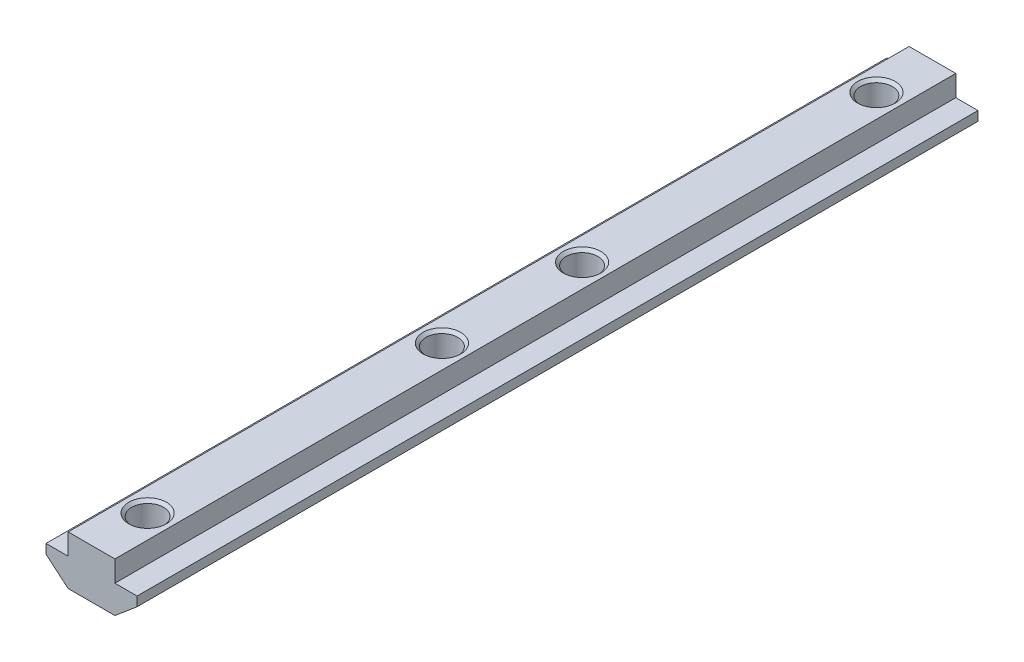
ISO-10303-21;
HEADER;
FILE_DESCRIPTION(('STEP AP214'),'2;1');
FILE_NAME('part.step','',(''),(''),'','','');
FILE_SCHEMA(('AUTOMOTIVE_DESIGN { 1 0 10303 214 1 1 1 1 }'));
ENDSEC;
DATA;
#1=APPLICATION_CONTEXT('core data for automotive mechanical design processes');
#2=APPLICATION_PROTOCOL_DEFINITION('international standard','automotive_design',2000,#1);
#3=PRODUCT_CONTEXT('',#1,'mechanical');
#4=PRODUCT('Part','Part','',(#3));
#5=PRODUCT_RELATED_PRODUCT_CATEGORY('part','',(#4));
#6=PRODUCT_DEFINITION_FORMATION('','',#4);
#7=PRODUCT_DEFINITION_CONTEXT('part definition',#1,'design');
#8=PRODUCT_DEFINITION('design','',#6,#7);
#9=PRODUCT_DEFINITION_SHAPE('','',#8);
#10=(LENGTH_UNIT() NAMED_UNIT(*) SI_UNIT(.MILLI.,.METRE.));
#11=(NAMED_UNIT(*) PLANE_ANGLE_UNIT() SI_UNIT($,.RADIAN.));
#12=(NAMED_UNIT(*) SI_UNIT($,.STERADIAN.) SOLID_ANGLE_UNIT());
#13=UNCERTAINTY_MEASURE_WITH_UNIT(LENGTH_MEASURE(1.E-05),#10,'distance_accuracy_value','');
#14=(GEOMETRIC_REPRESENTATION_CONTEXT(3) GLOBAL_UNCERTAINTY_ASSIGNED_CONTEXT((#13)) GLOBAL_UNIT_ASSIGNED_CONTEXT((#10,
#11,#12)) REPRESENTATION_CONTEXT('',''));
#15=CARTESIAN_POINT('',(0.,0.,0.));
#16=DIRECTION('',(0.,0.,1.));
#17=DIRECTION('',(1.,0.,0.));
#18=AXIS2_PLACEMENT_3D('',#15,#16,#17);
#19=CARTESIAN_POINT('',(-5.,0.,90.));
#20=DIRECTION('',(1.,0.,0.));
#21=DIRECTION('',(0.,1.,0.));
#22=AXIS2_PLACEMENT_3D('',#19,#20,#21);
#23=PLANE('',#22);
#24=DIRECTION('',(0.,-1.,0.));
#25=VECTOR('',#24,1.);
#26=CARTESIAN_POINT('',(-5.,0.,-90.));
#27=LINE('',#26,#25);
#28=CARTESIAN_POINT('',(-5.,0.,-90.));
#29=VERTEX_POINT('',#28);
#30=CARTESIAN_POINT('',(-5.,-4.5,-90.));
#31=VERTEX_POINT('',#30);
#32=EDGE_CURVE('E145',#29,#31,#27,.T.);
#33=ORIENTED_EDGE('',*,*,#32,.T.);
#34=DIRECTION('',(0.,0.,-1.));
#35=VECTOR('',#34,1.);
#36=CARTESIAN_POINT('',(-5.,-4.5,90.));
#37=LINE('',#36,#35);
#38=CARTESIAN_POINT('',(-5.,-4.5,90.));
#39=VERTEX_POINT('',#38);
#40=EDGE_CURVE('E11',#39,#31,#37,.T.);
#41=ORIENTED_EDGE('',*,*,#40,.F.);
#42=DIRECTION('',(0.,-1.,0.));
#43=VECTOR('',#42,1.);
#44=CARTESIAN_POINT('',(-5.,0.,90.));
#45=LINE('',#44,#43);
#46=CARTESIAN_POINT('',(-5.,0.,90.));
#47=VERTEX_POINT('',#46);
#48=EDGE_CURVE('E164',#47,#39,#45,.T.);
#49=ORIENTED_EDGE('',*,*,#48,.F.);
#50=DIRECTION('',(0.,0.,-1.));
#51=VECTOR('',#50,1.);
#52=CARTESIAN_POINT('',(-5.,0.,90.));
#53=LINE('',#52,#51);
#54=EDGE_CURVE('E141',#47,#29,#53,.T.);
#55=ORIENTED_EDGE('',*,*,#54,.T.);
#56=EDGE_LOOP('',(#33,#41,#49,#55));
#57=FACE_BOUND('',#56,.T.);
#58=ADVANCED_FACE('F37',(#57),#23,.F.);
#59=CARTESIAN_POINT('',(-5.,-4.5,90.));
#60=DIRECTION('',(0.,-1.,0.));
#61=DIRECTION('',(1.,0.,0.));
#62=AXIS2_PLACEMENT_3D('',#59,#60,#61);
#63=PLANE('',#62);
#64=DIRECTION('',(-1.,0.,0.));
#65=VECTOR('',#64,1.);
#66=CARTESIAN_POINT('',(-5.,-4.5,-90.));
#67=LINE('',#66,#65);
#68=CARTESIAN_POINT('',(-9.75,-4.5,-90.));
#69=VERTEX_POINT('',#68);
#70=EDGE_CURVE('E148',#31,#69,#67,.T.);
#71=ORIENTED_EDGE('',*,*,#70,.T.);
#72=DIRECTION('',(0.,0.,-1.));
#73=VECTOR('',#72,1.);
#74=CARTESIAN_POINT('',(-9.75,-4.5,90.));
#75=LINE('',#74,#73);
#76=CARTESIAN_POINT('',(-9.75,-4.5,90.));
#77=VERTEX_POINT('',#76);
#78=EDGE_CURVE('E45',#77,#69,#75,.T.);
#79=ORIENTED_EDGE('',*,*,#78,.F.);
#80=DIRECTION('',(-1.,0.,0.));
#81=VECTOR('',#80,1.);
#82=CARTESIAN_POINT('',(-5.,-4.5,90.));
#83=LINE('',#82,#81);
#84=EDGE_CURVE('E102',#39,#77,#83,.T.);
#85=ORIENTED_EDGE('',*,*,#84,.F.);
#86=ORIENTED_EDGE('',*,*,#40,.T.);
#87=EDGE_LOOP('',(#71,#79,#85,#86));
#88=FACE_BOUND('',#87,.T.);
#89=ADVANCED_FACE('F308',(#88),#63,.F.);
#90=CARTESIAN_POINT('',(-9.75,-4.5,90.));
#91=DIRECTION('',(1.,0.,0.));
#92=DIRECTION('',(0.,0.,-1.));
#93=AXIS2_PLACEMENT_3D('',#90,#91,#92);
#94=PLANE('',#93);
#95=DIRECTION('',(0.,-1.,0.));
#96=VECTOR('',#95,1.);
#97=CARTESIAN_POINT('',(-9.75,-4.5,-90.));
#98=LINE('',#97,#96);
#99=CARTESIAN_POINT('',(-9.75,-6.5,-90.));
#100=VERTEX_POINT('',#99);
#101=EDGE_CURVE('E151',#69,#100,#98,.T.);
#102=ORIENTED_EDGE('',*,*,#101,.T.);
#103=DIRECTION('',(0.,0.,-1.));
#104=VECTOR('',#103,1.);
#105=CARTESIAN_POINT('',(-9.75,-6.5,90.));
#106=LINE('',#105,#104);
#107=CARTESIAN_POINT('',(-9.75,-6.5,90.));
#108=VERTEX_POINT('',#107);
#109=EDGE_CURVE('E177',#108,#100,#106,.T.);
#110=ORIENTED_EDGE('',*,*,#109,.F.);
#111=DIRECTION('',(0.,-1.,0.));
#112=VECTOR('',#111,1.);
#113=CARTESIAN_POINT('',(-9.75,-4.5,90.));
#114=LINE('',#113,#112);
#115=EDGE_CURVE('E185',#77,#108,#114,.T.);
#116=ORIENTED_EDGE('',*,*,#115,.F.);
#117=ORIENTED_EDGE('',*,*,#78,.T.);
#118=EDGE_LOOP('',(#102,#110,#116,#117));
#119=FACE_BOUND('',#118,.T.);
#120=ADVANCED_FACE('F183',(#119),#94,.F.);
#121=CARTESIAN_POINT('',(-9.75,-6.5,90.));
#122=DIRECTION('',(0.64413574578278,0.764911198117051,0.));
#123=DIRECTION('',(-0.764911198117051,0.64413574578278,0.));
#124=AXIS2_PLACEMENT_3D('',#121,#122,#123);
#125=PLANE('',#124);
#126=DIRECTION('',(0.764911198117051,-0.64413574578278,0.));
#127=VECTOR('',#126,1.);
#128=CARTESIAN_POINT('',(-9.75,-6.5,-90.));
#129=LINE('',#128,#127);
#130=CARTESIAN_POINT('',(-5.,-10.5,-90.));
#131=VERTEX_POINT('',#130);
#132=EDGE_CURVE('E153',#100,#131,#129,.T.);
#133=ORIENTED_EDGE('',*,*,#132,.T.);
#134=DIRECTION('',(0.,0.,-1.));
#135=VECTOR('',#134,1.);
#136=CARTESIAN_POINT('',(-5.,-10.5,90.));
#137=LINE('',#136,#135);
#138=CARTESIAN_POINT('',(-5.,-10.5,90.));
#139=VERTEX_POINT('',#138);
#140=EDGE_CURVE('E174',#139,#131,#137,.T.);
#141=ORIENTED_EDGE('',*,*,#140,.F.);
#142=DIRECTION('',(0.764911198117051,-0.64413574578278,0.));
#143=VECTOR('',#142,1.);
#144=CARTESIAN_POINT('',(-9.75,-6.5,90.));
#145=LINE('',#144,#143);
#146=EDGE_CURVE('E203',#108,#139,#145,.T.);
#147=ORIENTED_EDGE('',*,*,#146,.F.);
#148=ORIENTED_EDGE('',*,*,#109,.T.);
#149=EDGE_LOOP('',(#133,#141,#147,#148));
#150=FACE_BOUND('',#149,.T.);
#151=ADVANCED_FACE('F194',(#150),#125,.F.);
#152=CARTESIAN_POINT('',(-5.,-10.5,90.));
#153=DIRECTION('',(0.,1.,0.));
#154=DIRECTION('',(0.,0.,1.));
#155=AXIS2_PLACEMENT_3D('',#152,#153,#154);
#156=PLANE('',#155);
#157=CARTESIAN_POINT('',(0.,-10.5,-78.));
#158=DIRECTION('',(0.,1.,0.));
#159=DIRECTION('',(0.,0.,1.));
#160=AXIS2_PLACEMENT_3D('',#157,#158,#159);
#161=CIRCLE('',#160,4.025);
#162=CARTESIAN_POINT('',(0.,-10.5,-73.975));
#163=VERTEX_POINT('',#162);
#164=EDGE_CURVE('E255',#163,#163,#161,.T.);
#165=ORIENTED_EDGE('',*,*,#164,.T.);
#166=EDGE_LOOP('',(#165));
#167=FACE_BOUND('',#166,.T.);
#168=CARTESIAN_POINT('',(0.,-10.5,-15.));
#169=DIRECTION('',(0.,1.,0.));
#170=DIRECTION('',(0.,0.,1.));
#171=AXIS2_PLACEMENT_3D('',#168,#169,#170);
#172=CIRCLE('',#171,4.025);
#173=CARTESIAN_POINT('',(0.,-10.5,-10.975));
#174=VERTEX_POINT('',#173);
#175=EDGE_CURVE('E243',#174,#174,#172,.T.);
#176=ORIENTED_EDGE('',*,*,#175,.T.);
#177=EDGE_LOOP('',(#176));
#178=FACE_BOUND('',#177,.T.);
#179=CARTESIAN_POINT('',(0.,-10.5,15.));
#180=DIRECTION('',(0.,1.,0.));
#181=DIRECTION('',(0.,0.,1.));
#182=AXIS2_PLACEMENT_3D('',#179,#180,#181);
#183=CIRCLE('',#182,4.025);
#184=CARTESIAN_POINT('',(0.,-10.5,19.025));
#185=VERTEX_POINT('',#184);
#186=EDGE_CURVE('E231',#185,#185,#183,.T.);
#187=ORIENTED_EDGE('',*,*,#186,.T.);
#188=EDGE_LOOP('',(#187));
#189=FACE_BOUND('',#188,.T.);
#190=CARTESIAN_POINT('',(0.,-10.5,78.));
#191=DIRECTION('',(0.,1.,0.));
#192=DIRECTION('',(0.,0.,1.));
#193=AXIS2_PLACEMENT_3D('',#190,#191,#192);
#194=CIRCLE('',#193,4.025);
#195=CARTESIAN_POINT('',(0.,-10.5,82.025));
#196=VERTEX_POINT('',#195);
#197=EDGE_CURVE('E219',#196,#196,#194,.T.);
#198=ORIENTED_EDGE('',*,*,#197,.T.);
#199=EDGE_LOOP('',(#198));
#200=FACE_BOUND('',#199,.T.);
#201=DIRECTION('',(1.,0.,0.));
#202=VECTOR('',#201,1.);
#203=CARTESIAN_POINT('',(-5.,-10.5,-90.));
#204=LINE('',#203,#202);
#205=CARTESIAN_POINT('',(5.,-10.5,-90.));
#206=VERTEX_POINT('',#205);
#207=EDGE_CURVE('E155',#131,#206,#204,.T.);
#208=ORIENTED_EDGE('',*,*,#207,.T.);
#209=DIRECTION('',(0.,0.,-1.));
#210=VECTOR('',#209,1.);
#211=CARTESIAN_POINT('',(5.,-10.5,90.));
#212=LINE('',#211,#210);
#213=CARTESIAN_POINT('',(5.,-10.5,90.));
#214=VERTEX_POINT('',#213);
#215=EDGE_CURVE('E171',#214,#206,#212,.T.);
#216=ORIENTED_EDGE('',*,*,#215,.F.);
#217=DIRECTION('',(1.,0.,0.));
#218=VECTOR('',#217,1.);
#219=CARTESIAN_POINT('',(-5.,-10.5,90.));
#220=LINE('',#219,#218);
#221=EDGE_CURVE('E200',#139,#214,#220,.T.);
#222=ORIENTED_EDGE('',*,*,#221,.F.);
#223=ORIENTED_EDGE('',*,*,#140,.T.);
#224=EDGE_LOOP('',(#208,#216,#222,#223));
#225=FACE_BOUND('',#224,.T.);
#226=ADVANCED_FACE('F198',(#167,#178,#189,#200,#225),#156,.F.);
#227=CARTESIAN_POINT('',(9.75,-6.5,90.));
#228=DIRECTION('',(-0.64413574578278,0.764911198117051,0.));
#229=DIRECTION('',(-0.764911198117051,-0.64413574578278,0.));
#230=AXIS2_PLACEMENT_3D('',#227,#228,#229);
#231=PLANE('',#230);
#232=DIRECTION('',(0.764911198117051,0.64413574578278,0.));
#233=VECTOR('',#232,1.);
#234=CARTESIAN_POINT('',(9.75,-6.5,-90.));
#235=LINE('',#234,#233);
#236=CARTESIAN_POINT('',(9.75,-6.5,-90.));
#237=VERTEX_POINT('',#236);
#238=EDGE_CURVE('E157',#206,#237,#235,.T.);
#239=ORIENTED_EDGE('',*,*,#238,.T.);
#240=DIRECTION('',(0.,0.,-1.));
#241=VECTOR('',#240,1.);
#242=CARTESIAN_POINT('',(9.75,-6.5,90.));
#243=LINE('',#242,#241);
#244=CARTESIAN_POINT('',(9.75,-6.5,90.));
#245=VERTEX_POINT('',#244);
#246=EDGE_CURVE('E168',#245,#237,#243,.T.);
#247=ORIENTED_EDGE('',*,*,#246,.F.);
#248=DIRECTION('',(0.764911198117051,0.64413574578278,0.));
#249=VECTOR('',#248,1.);
#250=CARTESIAN_POINT('',(9.75,-6.5,90.));
#251=LINE('',#250,#249);
#252=EDGE_CURVE('E202',#214,#245,#251,.T.);
#253=ORIENTED_EDGE('',*,*,#252,.F.);
#254=ORIENTED_EDGE('',*,*,#215,.T.);
#255=EDGE_LOOP('',(#239,#247,#253,#254));
#256=FACE_BOUND('',#255,.T.);
#257=ADVANCED_FACE('F320',(#256),#231,.F.);
#258=CARTESIAN_POINT('',(9.75,-4.5,90.));
#259=DIRECTION('',(-1.,0.,0.));
#260=DIRECTION('',(0.,0.,1.));
#261=AXIS2_PLACEMENT_3D('',#258,#259,#260);
#262=PLANE('',#261);
#263=DIRECTION('',(0.,1.,0.));
#264=VECTOR('',#263,1.);
#265=CARTESIAN_POINT('',(9.75,-4.5,-90.));
#266=LINE('',#265,#264);
#267=CARTESIAN_POINT('',(9.75,-4.5,-90.));
#268=VERTEX_POINT('',#267);
#269=EDGE_CURVE('E159',#237,#268,#266,.T.);
#270=ORIENTED_EDGE('',*,*,#269,.T.);
#271=DIRECTION('',(0.,0.,-1.));
#272=VECTOR('',#271,1.);
#273=CARTESIAN_POINT('',(9.75,-4.5,90.));
#274=LINE('',#273,#272);
#275=CARTESIAN_POINT('',(9.75,-4.5,90.));
#276=VERTEX_POINT('',#275);
#277=EDGE_CURVE('E136',#276,#268,#274,.T.);
#278=ORIENTED_EDGE('',*,*,#277,.F.);
#279=DIRECTION('',(0.,1.,0.));
#280=VECTOR('',#279,1.);
#281=CARTESIAN_POINT('',(9.75,-4.5,90.));
#282=LINE('',#281,#280);
#283=EDGE_CURVE('E127',#245,#276,#282,.T.);
#284=ORIENTED_EDGE('',*,*,#283,.F.);
#285=ORIENTED_EDGE('',*,*,#246,.T.);
#286=EDGE_LOOP('',(#270,#278,#284,#285));
#287=FACE_BOUND('',#286,.T.);
#288=ADVANCED_FACE('F317',(#287),#262,.F.);
#289=CARTESIAN_POINT('',(5.,-4.5,90.));
#290=DIRECTION('',(0.,-1.,0.));
#291=DIRECTION('',(1.,0.,0.));
#292=AXIS2_PLACEMENT_3D('',#289,#290,#291);
#293=PLANE('',#292);
#294=DIRECTION('',(-1.,0.,0.));
#295=VECTOR('',#294,1.);
#296=CARTESIAN_POINT('',(5.,-4.5,-90.));
#297=LINE('',#296,#295);
#298=CARTESIAN_POINT('',(5.,-4.5,-90.));
#299=VERTEX_POINT('',#298);
#300=EDGE_CURVE('E135',#268,#299,#297,.T.);
#301=ORIENTED_EDGE('',*,*,#300,.T.);
#302=DIRECTION('',(0.,0.,-1.));
#303=VECTOR('',#302,1.);
#304=CARTESIAN_POINT('',(5.,-4.5,90.));
#305=LINE('',#304,#303);
#306=CARTESIAN_POINT('',(5.,-4.5,90.));
#307=VERTEX_POINT('',#306);
#308=EDGE_CURVE('E132',#307,#299,#305,.T.);
#309=ORIENTED_EDGE('',*,*,#308,.F.);
#310=DIRECTION('',(-1.,0.,0.));
#311=VECTOR('',#310,1.);
#312=CARTESIAN_POINT('',(5.,-4.5,90.));
#313=LINE('',#312,#311);
#314=EDGE_CURVE('E121',#276,#307,#313,.T.);
#315=ORIENTED_EDGE('',*,*,#314,.F.);
#316=ORIENTED_EDGE('',*,*,#277,.T.);
#317=EDGE_LOOP('',(#301,#309,#315,#316));
#318=FACE_BOUND('',#317,.T.);
#319=ADVANCED_FACE('F133',(#318),#293,.F.);
#320=CARTESIAN_POINT('',(5.,0.,90.));
#321=DIRECTION('',(-1.,0.,0.));
#322=DIRECTION('',(0.,-1.,0.));
#323=AXIS2_PLACEMENT_3D('',#320,#321,#322);
#324=PLANE('',#323);
#325=DIRECTION('',(0.,1.,0.));
#326=VECTOR('',#325,1.);
#327=CARTESIAN_POINT('',(5.,0.,-90.));
#328=LINE('',#327,#326);
#329=CARTESIAN_POINT('',(5.,0.,-90.));
#330=VERTEX_POINT('',#329);
#331=EDGE_CURVE('E88',#299,#330,#328,.T.);
#332=ORIENTED_EDGE('',*,*,#331,.T.);
#333=DIRECTION('',(0.,0.,-1.));
#334=VECTOR('',#333,1.);
#335=CARTESIAN_POINT('',(5.,0.,90.));
#336=LINE('',#335,#334);
#337=CARTESIAN_POINT('',(5.,0.,90.));
#338=VERTEX_POINT('',#337);
#339=EDGE_CURVE('E137',#338,#330,#336,.T.);
#340=ORIENTED_EDGE('',*,*,#339,.F.);
#341=DIRECTION('',(0.,1.,0.));
#342=VECTOR('',#341,1.);
#343=CARTESIAN_POINT('',(5.,0.,90.));
#344=LINE('',#343,#342);
#345=EDGE_CURVE('E125',#307,#338,#344,.T.);
#346=ORIENTED_EDGE('',*,*,#345,.F.);
#347=ORIENTED_EDGE('',*,*,#308,.T.);
#348=EDGE_LOOP('',(#332,#340,#346,#347));
#349=FACE_BOUND('',#348,.T.);
#350=ADVANCED_FACE('F139',(#349),#324,.F.);
#351=CARTESIAN_POINT('',(5.,0.,90.));
#352=DIRECTION('',(0.,-1.,0.));
#353=DIRECTION('',(0.,0.,-1.));
#354=AXIS2_PLACEMENT_3D('',#351,#352,#353);
#355=PLANE('',#354);
#356=CARTESIAN_POINT('',(0.,0.,-78.));
#357=DIRECTION('',(0.,1.,0.));
#358=DIRECTION('',(0.,0.,1.));
#359=AXIS2_PLACEMENT_3D('',#356,#357,#358);
#360=CIRCLE('',#359,4.025);
#361=CARTESIAN_POINT('',(0.,0.,-73.975));
#362=VERTEX_POINT('',#361);
#363=EDGE_CURVE('E252',#362,#362,#360,.T.);
#364=ORIENTED_EDGE('',*,*,#363,.F.);
#365=EDGE_LOOP('',(#364));
#366=FACE_BOUND('',#365,.T.);
#367=CARTESIAN_POINT('',(0.,0.,-15.));
#368=DIRECTION('',(0.,1.,0.));
#369=DIRECTION('',(0.,0.,1.));
#370=AXIS2_PLACEMENT_3D('',#367,#368,#369);
#371=CIRCLE('',#370,4.025);
#372=CARTESIAN_POINT('',(0.,0.,-10.975));
#373=VERTEX_POINT('',#372);
#374=EDGE_CURVE('E240',#373,#373,#371,.T.);
#375=ORIENTED_EDGE('',*,*,#374,.F.);
#376=EDGE_LOOP('',(#375));
#377=FACE_BOUND('',#376,.T.);
#378=CARTESIAN_POINT('',(0.,0.,15.));
#379=DIRECTION('',(0.,1.,0.));
#380=DIRECTION('',(0.,0.,1.));
#381=AXIS2_PLACEMENT_3D('',#378,#379,#380);
#382=CIRCLE('',#381,4.025);
#383=CARTESIAN_POINT('',(0.,0.,19.025));
#384=VERTEX_POINT('',#383);
#385=EDGE_CURVE('E228',#384,#384,#382,.T.);
#386=ORIENTED_EDGE('',*,*,#385,.F.);
#387=EDGE_LOOP('',(#386));
#388=FACE_BOUND('',#387,.T.);
#389=CARTESIAN_POINT('',(0.,0.,78.));
#390=DIRECTION('',(0.,1.,0.));
#391=DIRECTION('',(0.,0.,1.));
#392=AXIS2_PLACEMENT_3D('',#389,#390,#391);
#393=CIRCLE('',#392,4.025);
#394=CARTESIAN_POINT('',(0.,0.,82.025));
#395=VERTEX_POINT('',#394);
#396=EDGE_CURVE('E216',#395,#395,#393,.T.);
#397=ORIENTED_EDGE('',*,*,#396,.F.);
#398=EDGE_LOOP('',(#397));
#399=FACE_BOUND('',#398,.T.);
#400=DIRECTION('',(-1.,0.,0.));
#401=VECTOR('',#400,1.);
#402=CARTESIAN_POINT('',(5.,0.,-90.));
#403=LINE('',#402,#401);
#404=EDGE_CURVE('E94',#330,#29,#403,.T.);
#405=ORIENTED_EDGE('',*,*,#404,.T.);
#406=ORIENTED_EDGE('',*,*,#54,.F.);
#407=DIRECTION('',(-1.,0.,0.));
#408=VECTOR('',#407,1.);
#409=CARTESIAN_POINT('',(5.,0.,90.));
#410=LINE('',#409,#408);
#411=EDGE_CURVE('E53',#338,#47,#410,.T.);
#412=ORIENTED_EDGE('',*,*,#411,.F.);
#413=ORIENTED_EDGE('',*,*,#339,.T.);
#414=EDGE_LOOP('',(#405,#406,#412,#413));
#415=FACE_BOUND('',#414,.T.);
#416=ADVANCED_FACE('F280',(#366,#377,#388,#399,#415),#355,.F.);
#417=CARTESIAN_POINT('',(0.,0.,90.));
#418=DIRECTION('',(0.,0.,-1.));
#419=DIRECTION('',(-1.,0.,0.));
#420=AXIS2_PLACEMENT_3D('',#417,#418,#419);
#421=PLANE('',#420);
#422=ORIENTED_EDGE('',*,*,#48,.T.);
#423=ORIENTED_EDGE('',*,*,#84,.T.);
#424=ORIENTED_EDGE('',*,*,#115,.T.);
#425=ORIENTED_EDGE('',*,*,#146,.T.);
#426=ORIENTED_EDGE('',*,*,#221,.T.);
#427=ORIENTED_EDGE('',*,*,#252,.T.);
#428=ORIENTED_EDGE('',*,*,#283,.T.);
#429=ORIENTED_EDGE('',*,*,#314,.T.);
#430=ORIENTED_EDGE('',*,*,#345,.T.);
#431=ORIENTED_EDGE('',*,*,#411,.T.);
#432=EDGE_LOOP('',(#422,#423,#424,#425,#426,#427,#428,#429,#430,#431));
#433=FACE_BOUND('',#432,.T.);
#434=ADVANCED_FACE('F123',(#433),#421,.F.);
#435=CARTESIAN_POINT('',(0.,0.,-90.));
#436=DIRECTION('',(0.,0.,-1.));
#437=DIRECTION('',(-1.,0.,0.));
#438=AXIS2_PLACEMENT_3D('',#435,#436,#437);
#439=PLANE('',#438);
#440=ORIENTED_EDGE('',*,*,#32,.F.);
#441=ORIENTED_EDGE('',*,*,#404,.F.);
#442=ORIENTED_EDGE('',*,*,#331,.F.);
#443=ORIENTED_EDGE('',*,*,#300,.F.);
#444=ORIENTED_EDGE('',*,*,#269,.F.);
#445=ORIENTED_EDGE('',*,*,#238,.F.);
#446=ORIENTED_EDGE('',*,*,#207,.F.);
#447=ORIENTED_EDGE('',*,*,#132,.F.);
#448=ORIENTED_EDGE('',*,*,#101,.F.);
#449=ORIENTED_EDGE('',*,*,#70,.F.);
#450=EDGE_LOOP('',(#440,#441,#442,#443,#444,#445,#446,#447,#448,#449));
#451=FACE_BOUND('',#450,.T.);
#452=ADVANCED_FACE('F189',(#451),#439,.T.);
#453=CARTESIAN_POINT('',(0.,-9.875,78.));
#454=DIRECTION('',(0.,-1.,0.));
#455=DIRECTION('',(0.,0.,-1.));
#456=AXIS2_PLACEMENT_3D('',#453,#454,#455);
#457=CONICAL_SURFACE('',#456,3.4,0.785398163397447);
#458=ORIENTED_EDGE('',*,*,#197,.F.);
#459=EDGE_LOOP('',(#458));
#460=FACE_BOUND('',#459,.T.);
#461=CARTESIAN_POINT('',(0.,-9.875,78.));
#462=DIRECTION('',(0.,1.,0.));
#463=DIRECTION('',(0.,0.,1.));
#464=AXIS2_PLACEMENT_3D('',#461,#462,#463);
#465=CIRCLE('',#464,3.4);
#466=CARTESIAN_POINT('',(0.,-9.875,81.4));
#467=VERTEX_POINT('',#466);
#468=EDGE_CURVE('E149',#467,#467,#465,.T.);
#469=ORIENTED_EDGE('',*,*,#468,.T.);
#470=EDGE_LOOP('',(#469));
#471=FACE_BOUND('',#470,.T.);
#472=ADVANCED_FACE('F303',(#460,#471),#457,.F.);
#473=CARTESIAN_POINT('',(0.,0.,78.));
#474=DIRECTION('',(0.,1.,0.));
#475=DIRECTION('',(0.,0.,1.));
#476=AXIS2_PLACEMENT_3D('',#473,#474,#475);
#477=CYLINDRICAL_SURFACE('',#476,3.4);
#478=ORIENTED_EDGE('',*,*,#468,.F.);
#479=EDGE_LOOP('',(#478));
#480=FACE_BOUND('',#479,.T.);
#481=CARTESIAN_POINT('',(0.,-0.625000000000002,78.));
#482=DIRECTION('',(0.,1.,0.));
#483=DIRECTION('',(0.,0.,1.));
#484=AXIS2_PLACEMENT_3D('',#481,#482,#483);
#485=CIRCLE('',#484,3.4);
#486=CARTESIAN_POINT('',(0.,-0.625000000000002,81.4));
#487=VERTEX_POINT('',#486);
#488=EDGE_CURVE('E213',#487,#487,#485,.T.);
#489=ORIENTED_EDGE('',*,*,#488,.T.);
#490=EDGE_LOOP('',(#489));
#491=FACE_BOUND('',#490,.T.);
#492=ADVANCED_FACE('F293',(#480,#491),#477,.F.);
#493=CARTESIAN_POINT('',(0.,0.,78.));
#494=DIRECTION('',(0.,1.,0.));
#495=DIRECTION('',(0.,0.,1.));
#496=AXIS2_PLACEMENT_3D('',#493,#494,#495);
#497=CONICAL_SURFACE('',#496,4.025,0.785398163397448);
#498=ORIENTED_EDGE('',*,*,#488,.F.);
#499=EDGE_LOOP('',(#498));
#500=FACE_BOUND('',#499,.T.);
#501=ORIENTED_EDGE('',*,*,#396,.T.);
#502=EDGE_LOOP('',(#501));
#503=FACE_BOUND('',#502,.T.);
#504=ADVANCED_FACE('F290',(#500,#503),#497,.F.);
#505=CARTESIAN_POINT('',(0.,-9.875,15.));
#506=DIRECTION('',(0.,-1.,0.));
#507=DIRECTION('',(0.,0.,-1.));
#508=AXIS2_PLACEMENT_3D('',#505,#506,#507);
#509=CONICAL_SURFACE('',#508,3.4,0.785398163397447);
#510=ORIENTED_EDGE('',*,*,#186,.F.);
#511=EDGE_LOOP('',(#510));
#512=FACE_BOUND('',#511,.T.);
#513=CARTESIAN_POINT('',(0.,-9.875,15.));
#514=DIRECTION('',(0.,1.,0.));
#515=DIRECTION('',(0.,0.,1.));
#516=AXIS2_PLACEMENT_3D('',#513,#514,#515);
#517=CIRCLE('',#516,3.4);
#518=CARTESIAN_POINT('',(0.,-9.875,18.4));
#519=VERTEX_POINT('',#518);
#520=EDGE_CURVE('E222',#519,#519,#517,.T.);
#521=ORIENTED_EDGE('',*,*,#520,.T.);
#522=EDGE_LOOP('',(#521));
#523=FACE_BOUND('',#522,.T.);
#524=ADVANCED_FACE('F292',(#512,#523),#509,.F.);
#525=CARTESIAN_POINT('',(0.,0.,15.));
#526=DIRECTION('',(0.,1.,0.));
#527=DIRECTION('',(0.,0.,1.));
#528=AXIS2_PLACEMENT_3D('',#525,#526,#527);
#529=CYLINDRICAL_SURFACE('',#528,3.4);
#530=ORIENTED_EDGE('',*,*,#520,.F.);
#531=EDGE_LOOP('',(#530));
#532=FACE_BOUND('',#531,.T.);
#533=CARTESIAN_POINT('',(0.,-0.625000000000002,15.));
#534=DIRECTION('',(0.,1.,0.));
#535=DIRECTION('',(0.,0.,1.));
#536=AXIS2_PLACEMENT_3D('',#533,#534,#535);
#537=CIRCLE('',#536,3.4);
#538=CARTESIAN_POINT('',(0.,-0.625000000000002,18.4));
#539=VERTEX_POINT('',#538);
#540=EDGE_CURVE('E225',#539,#539,#537,.T.);
#541=ORIENTED_EDGE('',*,*,#540,.T.);
#542=EDGE_LOOP('',(#541));
#543=FACE_BOUND('',#542,.T.);
#544=ADVANCED_FACE('F300',(#532,#543),#529,.F.);
#545=CARTESIAN_POINT('',(0.,0.,15.));
#546=DIRECTION('',(0.,1.,0.));
#547=DIRECTION('',(0.,0.,1.));
#548=AXIS2_PLACEMENT_3D('',#545,#546,#547);
#549=CONICAL_SURFACE('',#548,4.025,0.785398163397448);
#550=ORIENTED_EDGE('',*,*,#540,.F.);
#551=EDGE_LOOP('',(#550));
#552=FACE_BOUND('',#551,.T.);
#553=ORIENTED_EDGE('',*,*,#385,.T.);
#554=EDGE_LOOP('',(#553));
#555=FACE_BOUND('',#554,.T.);
#556=ADVANCED_FACE('F398',(#552,#555),#549,.F.);
#557=CARTESIAN_POINT('',(0.,-9.875,-15.));
#558=DIRECTION('',(0.,-1.,0.));
#559=DIRECTION('',(0.,0.,-1.));
#560=AXIS2_PLACEMENT_3D('',#557,#558,#559);
#561=CONICAL_SURFACE('',#560,3.4,0.785398163397447);
#562=ORIENTED_EDGE('',*,*,#175,.F.);
#563=EDGE_LOOP('',(#562));
#564=FACE_BOUND('',#563,.T.);
#565=CARTESIAN_POINT('',(0.,-9.875,-15.));
#566=DIRECTION('',(0.,1.,0.));
#567=DIRECTION('',(0.,0.,1.));
#568=AXIS2_PLACEMENT_3D('',#565,#566,#567);
#569=CIRCLE('',#568,3.4);
#570=CARTESIAN_POINT('',(0.,-9.875,-11.6));
#571=VERTEX_POINT('',#570);
#572=EDGE_CURVE('E234',#571,#571,#569,.T.);
#573=ORIENTED_EDGE('',*,*,#572,.T.);
#574=EDGE_LOOP('',(#573));
#575=FACE_BOUND('',#574,.T.);
#576=ADVANCED_FACE('F409',(#564,#575),#561,.F.);
#577=CARTESIAN_POINT('',(0.,0.,-15.));
#578=DIRECTION('',(0.,1.,0.));
#579=DIRECTION('',(0.,0.,1.));
#580=AXIS2_PLACEMENT_3D('',#577,#578,#579);
#581=CYLINDRICAL_SURFACE('',#580,3.4);
#582=ORIENTED_EDGE('',*,*,#572,.F.);
#583=EDGE_LOOP('',(#582));
#584=FACE_BOUND('',#583,.T.);
#585=CARTESIAN_POINT('',(0.,-0.625000000000002,-15.));
#586=DIRECTION('',(0.,1.,0.));
#587=DIRECTION('',(0.,0.,1.));
#588=AXIS2_PLACEMENT_3D('',#585,#586,#587);
#589=CIRCLE('',#588,3.4);
#590=CARTESIAN_POINT('',(0.,-0.625000000000002,-11.6));
#591=VERTEX_POINT('',#590);
#592=EDGE_CURVE('E237',#591,#591,#589,.T.);
#593=ORIENTED_EDGE('',*,*,#592,.T.);
#594=EDGE_LOOP('',(#593));
#595=FACE_BOUND('',#594,.T.);
#596=ADVANCED_FACE('F419',(#584,#595),#581,.F.);
#597=CARTESIAN_POINT('',(0.,0.,-15.));
#598=DIRECTION('',(0.,1.,0.));
#599=DIRECTION('',(0.,0.,1.));
#600=AXIS2_PLACEMENT_3D('',#597,#598,#599);
#601=CONICAL_SURFACE('',#600,4.025,0.785398163397448);
#602=ORIENTED_EDGE('',*,*,#592,.F.);
#603=EDGE_LOOP('',(#602));
#604=FACE_BOUND('',#603,.T.);
#605=ORIENTED_EDGE('',*,*,#374,.T.);
#606=EDGE_LOOP('',(#605));
#607=FACE_BOUND('',#606,.T.);
#608=ADVANCED_FACE('F265',(#604,#607),#601,.F.);
#609=CARTESIAN_POINT('',(0.,-9.875,-78.));
#610=DIRECTION('',(0.,-1.,0.));
#611=DIRECTION('',(0.,0.,-1.));
#612=AXIS2_PLACEMENT_3D('',#609,#610,#611);
#613=CONICAL_SURFACE('',#612,3.4,0.785398163397447);
#614=ORIENTED_EDGE('',*,*,#164,.F.);
#615=EDGE_LOOP('',(#614));
#616=FACE_BOUND('',#615,.T.);
#617=CARTESIAN_POINT('',(0.,-9.875,-78.));
#618=DIRECTION('',(0.,1.,0.));
#619=DIRECTION('',(0.,0.,1.));
#620=AXIS2_PLACEMENT_3D('',#617,#618,#619);
#621=CIRCLE('',#620,3.4);
#622=CARTESIAN_POINT('',(0.,-9.875,-74.6));
#623=VERTEX_POINT('',#622);
#624=EDGE_CURVE('E246',#623,#623,#621,.T.);
#625=ORIENTED_EDGE('',*,*,#624,.T.);
#626=EDGE_LOOP('',(#625));
#627=FACE_BOUND('',#626,.T.);
#628=ADVANCED_FACE('F261',(#616,#627),#613,.F.);
#629=CARTESIAN_POINT('',(0.,0.,-78.));
#630=DIRECTION('',(0.,1.,0.));
#631=DIRECTION('',(0.,0.,1.));
#632=AXIS2_PLACEMENT_3D('',#629,#630,#631);
#633=CYLINDRICAL_SURFACE('',#632,3.4);
#634=ORIENTED_EDGE('',*,*,#624,.F.);
#635=EDGE_LOOP('',(#634));
#636=FACE_BOUND('',#635,.T.);
#637=CARTESIAN_POINT('',(0.,-0.625000000000002,-78.));
#638=DIRECTION('',(0.,1.,0.));
#639=DIRECTION('',(0.,0.,1.));
#640=AXIS2_PLACEMENT_3D('',#637,#638,#639);
#641=CIRCLE('',#640,3.4);
#642=CARTESIAN_POINT('',(0.,-0.625000000000002,-74.6));
#643=VERTEX_POINT('',#642);
#644=EDGE_CURVE('E249',#643,#643,#641,.T.);
#645=ORIENTED_EDGE('',*,*,#644,.T.);
#646=EDGE_LOOP('',(#645));
#647=FACE_BOUND('',#646,.T.);
#648=ADVANCED_FACE('F264',(#636,#647),#633,.F.);
#649=CARTESIAN_POINT('',(0.,0.,-78.));
#650=DIRECTION('',(0.,1.,0.));
#651=DIRECTION('',(0.,0.,1.));
#652=AXIS2_PLACEMENT_3D('',#649,#650,#651);
#653=CONICAL_SURFACE('',#652,4.025,0.785398163397448);
#654=ORIENTED_EDGE('',*,*,#644,.F.);
#655=EDGE_LOOP('',(#654));
#656=FACE_BOUND('',#655,.T.);
#657=ORIENTED_EDGE('',*,*,#363,.T.);
#658=EDGE_LOOP('',(#657));
#659=FACE_BOUND('',#658,.T.);
#660=ADVANCED_FACE('F271',(#656,#659),#653,.F.);
#661=CLOSED_SHELL('',(#58,#89,#120,#151,#226,#257,#288,#319,#350,#416,#434,#452,#472,#492,#504,
#524,#544,#556,#576,#596,#608,#628,#648,#660));
#662=MANIFOLD_SOLID_BREP('B2',#661);
#663=ADVANCED_BREP_SHAPE_REPRESENTATION('',(#18,#662),#14);
#664=SHAPE_DEFINITION_REPRESENTATION(#9,#663);
ENDSEC;
END-ISO-10303-21;
